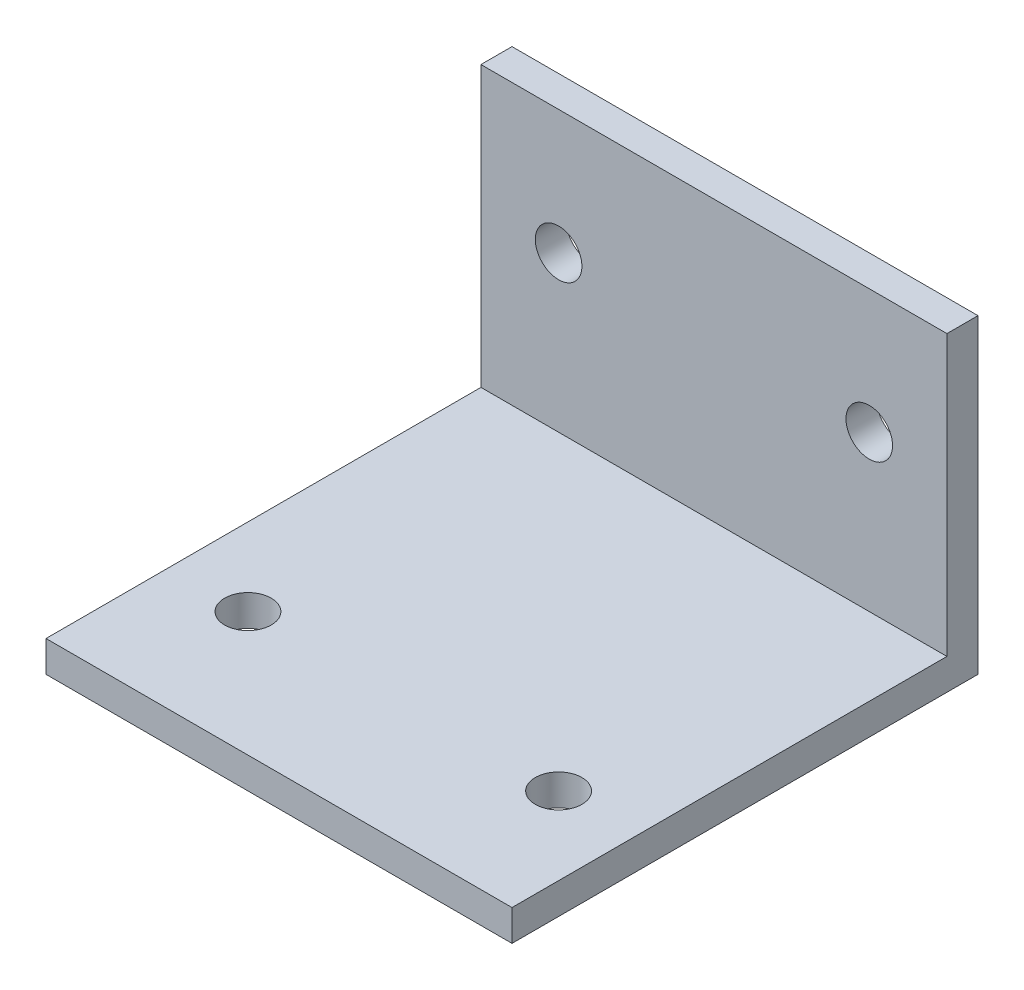
ISO-10303-21;
HEADER;
FILE_DESCRIPTION(('STEP AP214'),'2;1');
FILE_NAME('part.step','',(''),(''),'','','');
FILE_SCHEMA(('AUTOMOTIVE_DESIGN { 1 0 10303 214 1 1 1 1 }'));
ENDSEC;
DATA;
#1=APPLICATION_CONTEXT('core data for automotive mechanical design processes');
#2=APPLICATION_PROTOCOL_DEFINITION('international standard','automotive_design',2000,#1);
#3=PRODUCT_CONTEXT('',#1,'mechanical');
#4=PRODUCT('Part','Part','',(#3));
#5=PRODUCT_RELATED_PRODUCT_CATEGORY('part','',(#4));
#6=PRODUCT_DEFINITION_FORMATION('','',#4);
#7=PRODUCT_DEFINITION_CONTEXT('part definition',#1,'design');
#8=PRODUCT_DEFINITION('design','',#6,#7);
#9=PRODUCT_DEFINITION_SHAPE('','',#8);
#10=(LENGTH_UNIT() NAMED_UNIT(*) SI_UNIT(.MILLI.,.METRE.));
#11=(NAMED_UNIT(*) PLANE_ANGLE_UNIT() SI_UNIT($,.RADIAN.));
#12=(NAMED_UNIT(*) SI_UNIT($,.STERADIAN.) SOLID_ANGLE_UNIT());
#13=UNCERTAINTY_MEASURE_WITH_UNIT(LENGTH_MEASURE(1.E-05),#10,'distance_accuracy_value','');
#14=(GEOMETRIC_REPRESENTATION_CONTEXT(3) GLOBAL_UNCERTAINTY_ASSIGNED_CONTEXT((#13)) GLOBAL_UNIT_ASSIGNED_CONTEXT((#10,
#11,#12)) REPRESENTATION_CONTEXT('',''));
#15=CARTESIAN_POINT('',(0.,0.,0.));
#16=DIRECTION('',(0.,0.,1.));
#17=DIRECTION('',(1.,0.,0.));
#18=AXIS2_PLACEMENT_3D('',#15,#16,#17);
#19=CARTESIAN_POINT('',(15.,19.,3.));
#20=DIRECTION('',(-1.,0.,0.));
#21=DIRECTION('',(0.,0.,1.));
#22=AXIS2_PLACEMENT_3D('',#19,#20,#21);
#23=PLANE('',#22);
#24=DIRECTION('',(0.,0.,-1.));
#25=VECTOR('',#24,1.);
#26=CARTESIAN_POINT('',(15.,2.,3.));
#27=LINE('',#26,#25);
#28=CARTESIAN_POINT('',(15.,2.,3.));
#29=VERTEX_POINT('',#28);
#30=CARTESIAN_POINT('',(15.,2.,1.));
#31=VERTEX_POINT('',#30);
#32=EDGE_CURVE('E47',#29,#31,#27,.T.);
#33=ORIENTED_EDGE('',*,*,#32,.F.);
#34=DIRECTION('',(0.,1.,0.));
#35=VECTOR('',#34,1.);
#36=CARTESIAN_POINT('',(15.,19.,3.));
#37=LINE('',#36,#35);
#38=CARTESIAN_POINT('',(15.,-16.,3.));
#39=VERTEX_POINT('',#38);
#40=EDGE_CURVE('E144',#39,#29,#37,.T.);
#41=ORIENTED_EDGE('',*,*,#40,.F.);
#42=DIRECTION('',(0.,0.,-1.));
#43=VECTOR('',#42,1.);
#44=CARTESIAN_POINT('',(15.,-16.,38.));
#45=LINE('',#44,#43);
#46=CARTESIAN_POINT('',(15.,-16.,31.));
#47=VERTEX_POINT('',#46);
#48=EDGE_CURVE('E142',#47,#39,#45,.T.);
#49=ORIENTED_EDGE('',*,*,#48,.F.);
#50=DIRECTION('',(0.,1.,0.));
#51=VECTOR('',#50,1.);
#52=CARTESIAN_POINT('',(15.,19.,31.));
#53=LINE('',#52,#51);
#54=CARTESIAN_POINT('',(15.,-18.,31.));
#55=VERTEX_POINT('',#54);
#56=EDGE_CURVE('E107',#55,#47,#53,.T.);
#57=ORIENTED_EDGE('',*,*,#56,.F.);
#58=DIRECTION('',(0.,0.,1.));
#59=VECTOR('',#58,1.);
#60=CARTESIAN_POINT('',(15.,-18.,3.));
#61=LINE('',#60,#59);
#62=CARTESIAN_POINT('',(15.,-18.,1.));
#63=VERTEX_POINT('',#62);
#64=EDGE_CURVE('E122',#63,#55,#61,.T.);
#65=ORIENTED_EDGE('',*,*,#64,.F.);
#66=DIRECTION('',(0.,1.,0.));
#67=VECTOR('',#66,1.);
#68=CARTESIAN_POINT('',(15.,19.,1.));
#69=LINE('',#68,#67);
#70=EDGE_CURVE('E102',#63,#31,#69,.T.);
#71=ORIENTED_EDGE('',*,*,#70,.T.);
#72=EDGE_LOOP('',(#33,#41,#49,#57,#65,#71));
#73=FACE_BOUND('',#72,.T.);
#74=ADVANCED_FACE('F34',(#73),#23,.F.);
#75=CARTESIAN_POINT('',(-15.,19.,3.));
#76=DIRECTION('',(1.,0.,0.));
#77=DIRECTION('',(0.,0.,-1.));
#78=AXIS2_PLACEMENT_3D('',#75,#76,#77);
#79=PLANE('',#78);
#80=DIRECTION('',(0.,0.,1.));
#81=VECTOR('',#80,1.);
#82=CARTESIAN_POINT('',(-15.,2.,3.));
#83=LINE('',#82,#81);
#84=CARTESIAN_POINT('',(-15.,2.,1.));
#85=VERTEX_POINT('',#84);
#86=CARTESIAN_POINT('',(-15.,2.,3.));
#87=VERTEX_POINT('',#86);
#88=EDGE_CURVE('E84',#85,#87,#83,.T.);
#89=ORIENTED_EDGE('',*,*,#88,.F.);
#90=DIRECTION('',(0.,-1.,0.));
#91=VECTOR('',#90,1.);
#92=CARTESIAN_POINT('',(-15.,19.,1.));
#93=LINE('',#92,#91);
#94=CARTESIAN_POINT('',(-15.,-18.,1.));
#95=VERTEX_POINT('',#94);
#96=EDGE_CURVE('E93',#85,#95,#93,.T.);
#97=ORIENTED_EDGE('',*,*,#96,.T.);
#98=DIRECTION('',(0.,0.,-1.));
#99=VECTOR('',#98,1.);
#100=CARTESIAN_POINT('',(-15.,-18.,3.));
#101=LINE('',#100,#99);
#102=CARTESIAN_POINT('',(-15.,-18.,31.));
#103=VERTEX_POINT('',#102);
#104=EDGE_CURVE('E120',#103,#95,#101,.T.);
#105=ORIENTED_EDGE('',*,*,#104,.F.);
#106=DIRECTION('',(0.,-1.,0.));
#107=VECTOR('',#106,1.);
#108=CARTESIAN_POINT('',(-15.,19.,31.));
#109=LINE('',#108,#107);
#110=CARTESIAN_POINT('',(-15.,-16.,31.));
#111=VERTEX_POINT('',#110);
#112=EDGE_CURVE('E55',#111,#103,#109,.T.);
#113=ORIENTED_EDGE('',*,*,#112,.F.);
#114=DIRECTION('',(0.,0.,-1.));
#115=VECTOR('',#114,1.);
#116=CARTESIAN_POINT('',(-15.,-16.,38.));
#117=LINE('',#116,#115);
#118=CARTESIAN_POINT('',(-15.,-16.,3.));
#119=VERTEX_POINT('',#118);
#120=EDGE_CURVE('E140',#111,#119,#117,.T.);
#121=ORIENTED_EDGE('',*,*,#120,.T.);
#122=DIRECTION('',(0.,-1.,0.));
#123=VECTOR('',#122,1.);
#124=CARTESIAN_POINT('',(-15.,19.,3.));
#125=LINE('',#124,#123);
#126=EDGE_CURVE('E96',#87,#119,#125,.T.);
#127=ORIENTED_EDGE('',*,*,#126,.F.);
#128=EDGE_LOOP('',(#89,#97,#105,#113,#121,#127));
#129=FACE_BOUND('',#128,.T.);
#130=ADVANCED_FACE('F91',(#129),#79,.F.);
#131=CARTESIAN_POINT('',(0.,0.,3.));
#132=DIRECTION('',(0.,0.,1.));
#133=DIRECTION('',(1.,0.,0.));
#134=AXIS2_PLACEMENT_3D('',#131,#132,#133);
#135=PLANE('',#134);
#136=CARTESIAN_POINT('',(9.99999999999999,-6.,3.));
#137=DIRECTION('',(0.,0.,1.));
#138=DIRECTION('',(1.,0.,0.));
#139=AXIS2_PLACEMENT_3D('',#136,#137,#138);
#140=CIRCLE('',#139,1.5);
#141=CARTESIAN_POINT('',(11.5,-6.,3.));
#142=VERTEX_POINT('',#141);
#143=EDGE_CURVE('E131',#142,#142,#140,.T.);
#144=ORIENTED_EDGE('',*,*,#143,.F.);
#145=EDGE_LOOP('',(#144));
#146=FACE_BOUND('',#145,.T.);
#147=CARTESIAN_POINT('',(-10.,-6.,3.));
#148=DIRECTION('',(0.,0.,1.));
#149=DIRECTION('',(1.,0.,0.));
#150=AXIS2_PLACEMENT_3D('',#147,#148,#149);
#151=CIRCLE('',#150,1.5);
#152=CARTESIAN_POINT('',(-8.5,-6.,3.));
#153=VERTEX_POINT('',#152);
#154=EDGE_CURVE('E134',#153,#153,#151,.T.);
#155=ORIENTED_EDGE('',*,*,#154,.F.);
#156=EDGE_LOOP('',(#155));
#157=FACE_BOUND('',#156,.T.);
#158=ORIENTED_EDGE('',*,*,#40,.T.);
#159=DIRECTION('',(-1.,0.,0.));
#160=VECTOR('',#159,1.);
#161=CARTESIAN_POINT('',(0.,2.,3.));
#162=LINE('',#161,#160);
#163=EDGE_CURVE('E155',#29,#87,#162,.T.);
#164=ORIENTED_EDGE('',*,*,#163,.T.);
#165=ORIENTED_EDGE('',*,*,#126,.T.);
#166=DIRECTION('',(-1.,0.,0.));
#167=VECTOR('',#166,1.);
#168=CARTESIAN_POINT('',(-15.,-16.,3.));
#169=LINE('',#168,#167);
#170=EDGE_CURVE('E137',#39,#119,#169,.T.);
#171=ORIENTED_EDGE('',*,*,#170,.F.);
#172=EDGE_LOOP('',(#158,#164,#165,#171));
#173=FACE_BOUND('',#172,.T.);
#174=ADVANCED_FACE('F164',(#146,#157,#173),#135,.T.);
#175=CARTESIAN_POINT('',(0.,0.,1.));
#176=DIRECTION('',(0.,0.,1.));
#177=DIRECTION('',(1.,0.,0.));
#178=AXIS2_PLACEMENT_3D('',#175,#176,#177);
#179=PLANE('',#178);
#180=CARTESIAN_POINT('',(-10.,-6.,1.));
#181=DIRECTION('',(0.,0.,1.));
#182=DIRECTION('',(1.,0.,0.));
#183=AXIS2_PLACEMENT_3D('',#180,#181,#182);
#184=CIRCLE('',#183,1.5);
#185=CARTESIAN_POINT('',(-8.5,-6.,1.));
#186=VERTEX_POINT('',#185);
#187=EDGE_CURVE('E113',#186,#186,#184,.F.);
#188=ORIENTED_EDGE('',*,*,#187,.F.);
#189=EDGE_LOOP('',(#188));
#190=FACE_BOUND('',#189,.T.);
#191=CARTESIAN_POINT('',(9.99999999999999,-6.,1.));
#192=DIRECTION('',(0.,0.,1.));
#193=DIRECTION('',(1.,0.,0.));
#194=AXIS2_PLACEMENT_3D('',#191,#192,#193);
#195=CIRCLE('',#194,1.5);
#196=CARTESIAN_POINT('',(11.5,-6.,1.));
#197=VERTEX_POINT('',#196);
#198=EDGE_CURVE('E105',#197,#197,#195,.F.);
#199=ORIENTED_EDGE('',*,*,#198,.F.);
#200=EDGE_LOOP('',(#199));
#201=FACE_BOUND('',#200,.T.);
#202=DIRECTION('',(-1.,0.,0.));
#203=VECTOR('',#202,1.);
#204=CARTESIAN_POINT('',(0.,2.,1.));
#205=LINE('',#204,#203);
#206=EDGE_CURVE('E11',#31,#85,#205,.T.);
#207=ORIENTED_EDGE('',*,*,#206,.F.);
#208=ORIENTED_EDGE('',*,*,#70,.F.);
#209=DIRECTION('',(-1.,0.,0.));
#210=VECTOR('',#209,1.);
#211=CARTESIAN_POINT('',(0.,-18.,1.));
#212=LINE('',#211,#210);
#213=EDGE_CURVE('E101',#63,#95,#212,.T.);
#214=ORIENTED_EDGE('',*,*,#213,.T.);
#215=ORIENTED_EDGE('',*,*,#96,.F.);
#216=EDGE_LOOP('',(#207,#208,#214,#215));
#217=FACE_BOUND('',#216,.T.);
#218=ADVANCED_FACE('F99',(#190,#201,#217),#179,.F.);
#219=CARTESIAN_POINT('',(-15.,-16.,38.));
#220=DIRECTION('',(0.,-1.,0.));
#221=DIRECTION('',(0.,0.,-1.));
#222=AXIS2_PLACEMENT_3D('',#219,#220,#221);
#223=PLANE('',#222);
#224=CARTESIAN_POINT('',(-10.,-16.,23.));
#225=DIRECTION('',(0.,1.,0.));
#226=DIRECTION('',(0.,0.,1.));
#227=AXIS2_PLACEMENT_3D('',#224,#225,#226);
#228=CIRCLE('',#227,1.5);
#229=CARTESIAN_POINT('',(-10.,-16.,24.5));
#230=VERTEX_POINT('',#229);
#231=EDGE_CURVE('E128',#230,#230,#228,.T.);
#232=ORIENTED_EDGE('',*,*,#231,.F.);
#233=EDGE_LOOP('',(#232));
#234=FACE_BOUND('',#233,.T.);
#235=CARTESIAN_POINT('',(9.99999999999999,-16.,23.));
#236=DIRECTION('',(0.,1.,0.));
#237=DIRECTION('',(0.,0.,1.));
#238=AXIS2_PLACEMENT_3D('',#235,#236,#237);
#239=CIRCLE('',#238,1.5);
#240=CARTESIAN_POINT('',(9.99999999999999,-16.,24.5));
#241=VERTEX_POINT('',#240);
#242=EDGE_CURVE('E125',#241,#241,#239,.T.);
#243=ORIENTED_EDGE('',*,*,#242,.F.);
#244=EDGE_LOOP('',(#243));
#245=FACE_BOUND('',#244,.T.);
#246=DIRECTION('',(-1.,0.,0.));
#247=VECTOR('',#246,1.);
#248=CARTESIAN_POINT('',(-15.,-16.,31.));
#249=LINE('',#248,#247);
#250=EDGE_CURVE('E103',#47,#111,#249,.T.);
#251=ORIENTED_EDGE('',*,*,#250,.F.);
#252=ORIENTED_EDGE('',*,*,#48,.T.);
#253=ORIENTED_EDGE('',*,*,#170,.T.);
#254=ORIENTED_EDGE('',*,*,#120,.F.);
#255=EDGE_LOOP('',(#251,#252,#253,#254));
#256=FACE_BOUND('',#255,.T.);
#257=ADVANCED_FACE('F159',(#234,#245,#256),#223,.F.);
#258=CARTESIAN_POINT('',(0.,-18.,0.));
#259=DIRECTION('',(0.,-1.,0.));
#260=DIRECTION('',(0.,0.,-1.));
#261=AXIS2_PLACEMENT_3D('',#258,#259,#260);
#262=PLANE('',#261);
#263=CARTESIAN_POINT('',(-10.,-18.,23.));
#264=DIRECTION('',(0.,-1.,0.));
#265=DIRECTION('',(0.,0.,-1.));
#266=AXIS2_PLACEMENT_3D('',#263,#264,#265);
#267=CIRCLE('',#266,1.5);
#268=CARTESIAN_POINT('',(-10.,-18.,21.5));
#269=VERTEX_POINT('',#268);
#270=EDGE_CURVE('E117',#269,#269,#267,.F.);
#271=ORIENTED_EDGE('',*,*,#270,.T.);
#272=EDGE_LOOP('',(#271));
#273=FACE_BOUND('',#272,.T.);
#274=CARTESIAN_POINT('',(9.99999999999999,-18.,23.));
#275=DIRECTION('',(0.,-1.,0.));
#276=DIRECTION('',(0.,0.,-1.));
#277=AXIS2_PLACEMENT_3D('',#274,#275,#276);
#278=CIRCLE('',#277,1.5);
#279=CARTESIAN_POINT('',(9.99999999999999,-18.,21.5));
#280=VERTEX_POINT('',#279);
#281=EDGE_CURVE('E116',#280,#280,#278,.F.);
#282=ORIENTED_EDGE('',*,*,#281,.T.);
#283=EDGE_LOOP('',(#282));
#284=FACE_BOUND('',#283,.T.);
#285=ORIENTED_EDGE('',*,*,#64,.T.);
#286=DIRECTION('',(-1.,0.,0.));
#287=VECTOR('',#286,1.);
#288=CARTESIAN_POINT('',(0.,-18.,31.));
#289=LINE('',#288,#287);
#290=EDGE_CURVE('E41',#55,#103,#289,.T.);
#291=ORIENTED_EDGE('',*,*,#290,.T.);
#292=ORIENTED_EDGE('',*,*,#104,.T.);
#293=ORIENTED_EDGE('',*,*,#213,.F.);
#294=EDGE_LOOP('',(#285,#291,#292,#293));
#295=FACE_BOUND('',#294,.T.);
#296=ADVANCED_FACE('F151',(#273,#284,#295),#262,.T.);
#297=CARTESIAN_POINT('',(-10.,-51.,23.));
#298=DIRECTION('',(0.,1.,0.));
#299=DIRECTION('',(0.,0.,1.));
#300=AXIS2_PLACEMENT_3D('',#297,#298,#299);
#301=CYLINDRICAL_SURFACE('',#300,1.5);
#302=ORIENTED_EDGE('',*,*,#231,.T.);
#303=EDGE_LOOP('',(#302));
#304=FACE_BOUND('',#303,.T.);
#305=ORIENTED_EDGE('',*,*,#270,.F.);
#306=EDGE_LOOP('',(#305));
#307=FACE_BOUND('',#306,.T.);
#308=ADVANCED_FACE('F198',(#304,#307),#301,.F.);
#309=CARTESIAN_POINT('',(9.99999999999999,-51.,23.));
#310=DIRECTION('',(0.,1.,0.));
#311=DIRECTION('',(0.,0.,1.));
#312=AXIS2_PLACEMENT_3D('',#309,#310,#311);
#313=CYLINDRICAL_SURFACE('',#312,1.5);
#314=ORIENTED_EDGE('',*,*,#242,.T.);
#315=EDGE_LOOP('',(#314));
#316=FACE_BOUND('',#315,.T.);
#317=ORIENTED_EDGE('',*,*,#281,.F.);
#318=EDGE_LOOP('',(#317));
#319=FACE_BOUND('',#318,.T.);
#320=ADVANCED_FACE('F195',(#316,#319),#313,.F.);
#321=CARTESIAN_POINT('',(-10.,-6.,-32.));
#322=DIRECTION('',(0.,0.,1.));
#323=DIRECTION('',(1.,0.,0.));
#324=AXIS2_PLACEMENT_3D('',#321,#322,#323);
#325=CYLINDRICAL_SURFACE('',#324,1.5);
#326=ORIENTED_EDGE('',*,*,#187,.T.);
#327=EDGE_LOOP('',(#326));
#328=FACE_BOUND('',#327,.T.);
#329=ORIENTED_EDGE('',*,*,#154,.T.);
#330=EDGE_LOOP('',(#329));
#331=FACE_BOUND('',#330,.T.);
#332=ADVANCED_FACE('F177',(#328,#331),#325,.F.);
#333=CARTESIAN_POINT('',(9.99999999999999,-6.,-32.));
#334=DIRECTION('',(0.,0.,1.));
#335=DIRECTION('',(1.,0.,0.));
#336=AXIS2_PLACEMENT_3D('',#333,#334,#335);
#337=CYLINDRICAL_SURFACE('',#336,1.5);
#338=ORIENTED_EDGE('',*,*,#198,.T.);
#339=EDGE_LOOP('',(#338));
#340=FACE_BOUND('',#339,.T.);
#341=ORIENTED_EDGE('',*,*,#143,.T.);
#342=EDGE_LOOP('',(#341));
#343=FACE_BOUND('',#342,.T.);
#344=ADVANCED_FACE('F170',(#340,#343),#337,.F.);
#345=CARTESIAN_POINT('',(0.,0.,31.));
#346=DIRECTION('',(0.,0.,1.));
#347=DIRECTION('',(1.,0.,0.));
#348=AXIS2_PLACEMENT_3D('',#345,#346,#347);
#349=PLANE('',#348);
#350=ORIENTED_EDGE('',*,*,#250,.T.);
#351=ORIENTED_EDGE('',*,*,#112,.T.);
#352=ORIENTED_EDGE('',*,*,#290,.F.);
#353=ORIENTED_EDGE('',*,*,#56,.T.);
#354=EDGE_LOOP('',(#350,#351,#352,#353));
#355=FACE_BOUND('',#354,.T.);
#356=ADVANCED_FACE('F168',(#355),#349,.T.);
#357=CARTESIAN_POINT('',(0.,2.,0.));
#358=DIRECTION('',(0.,1.,0.));
#359=DIRECTION('',(0.,0.,1.));
#360=AXIS2_PLACEMENT_3D('',#357,#358,#359);
#361=PLANE('',#360);
#362=ORIENTED_EDGE('',*,*,#32,.T.);
#363=ORIENTED_EDGE('',*,*,#206,.T.);
#364=ORIENTED_EDGE('',*,*,#88,.T.);
#365=ORIENTED_EDGE('',*,*,#163,.F.);
#366=EDGE_LOOP('',(#362,#363,#364,#365));
#367=FACE_BOUND('',#366,.T.);
#368=ADVANCED_FACE('F83',(#367),#361,.T.);
#369=CLOSED_SHELL('',(#74,#130,#174,#218,#257,#296,#308,#320,#332,#344,#356,#368));
#370=MANIFOLD_SOLID_BREP('B2',#369);
#371=ADVANCED_BREP_SHAPE_REPRESENTATION('',(#18,#370),#14);
#372=SHAPE_DEFINITION_REPRESENTATION(#9,#371);
ENDSEC;
END-ISO-10303-21;
